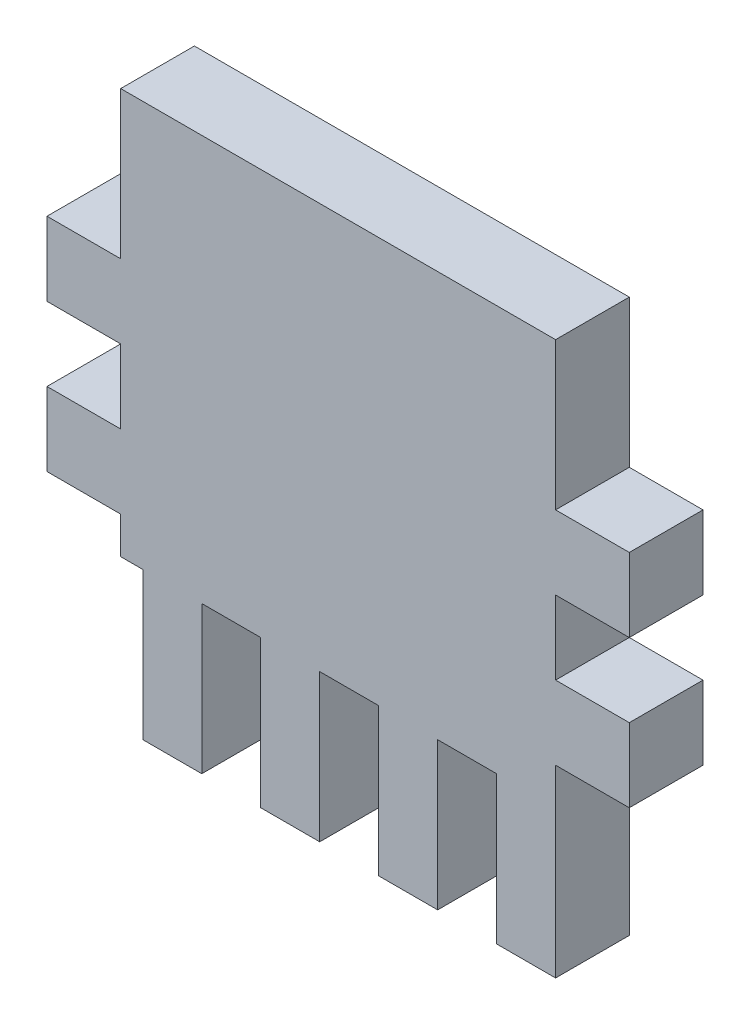
ISO-10303-21;
HEADER;
FILE_DESCRIPTION(('STEP AP214'),'2;1');
FILE_NAME('part.step','',(''),(''),'','','');
FILE_SCHEMA(('AUTOMOTIVE_DESIGN { 1 0 10303 214 1 1 1 1 }'));
ENDSEC;
DATA;
#1=APPLICATION_CONTEXT('core data for automotive mechanical design processes');
#2=APPLICATION_PROTOCOL_DEFINITION('international standard','automotive_design',2000,#1);
#3=PRODUCT_CONTEXT('',#1,'mechanical');
#4=PRODUCT('Part','Part','',(#3));
#5=PRODUCT_RELATED_PRODUCT_CATEGORY('part','',(#4));
#6=PRODUCT_DEFINITION_FORMATION('','',#4);
#7=PRODUCT_DEFINITION_CONTEXT('part definition',#1,'design');
#8=PRODUCT_DEFINITION('design','',#6,#7);
#9=PRODUCT_DEFINITION_SHAPE('','',#8);
#10=(LENGTH_UNIT() NAMED_UNIT(*) SI_UNIT(.MILLI.,.METRE.));
#11=(NAMED_UNIT(*) PLANE_ANGLE_UNIT() SI_UNIT($,.RADIAN.));
#12=(NAMED_UNIT(*) SI_UNIT($,.STERADIAN.) SOLID_ANGLE_UNIT());
#13=UNCERTAINTY_MEASURE_WITH_UNIT(LENGTH_MEASURE(1.E-05),#10,'distance_accuracy_value','');
#14=(GEOMETRIC_REPRESENTATION_CONTEXT(3) GLOBAL_UNCERTAINTY_ASSIGNED_CONTEXT((#13)) GLOBAL_UNIT_ASSIGNED_CONTEXT((#10,
#11,#12)) REPRESENTATION_CONTEXT('',''));
#15=CARTESIAN_POINT('',(0.,0.,0.));
#16=DIRECTION('',(0.,0.,1.));
#17=DIRECTION('',(1.,0.,0.));
#18=AXIS2_PLACEMENT_3D('',#15,#16,#17);
#19=CARTESIAN_POINT('',(0.,-8.71306122857178,5.));
#20=DIRECTION('',(0.,1.,0.));
#21=DIRECTION('',(-1.,0.,0.));
#22=AXIS2_PLACEMENT_3D('',#19,#20,#21);
#23=PLANE('',#22);
#24=DIRECTION('',(1.,0.,0.));
#25=VECTOR('',#24,1.);
#26=CARTESIAN_POINT('',(0.,-8.71306122857178,0.));
#27=LINE('',#26,#25);
#28=CARTESIAN_POINT('',(-8.40934146575976,-8.71306122857178,0.));
#29=VERTEX_POINT('',#28);
#30=CARTESIAN_POINT('',(-4.40934146575976,-8.71306122857178,0.));
#31=VERTEX_POINT('',#30);
#32=EDGE_CURVE('E370',#29,#31,#27,.T.);
#33=ORIENTED_EDGE('',*,*,#32,.T.);
#34=DIRECTION('',(0.,0.,-1.));
#35=VECTOR('',#34,1.);
#36=CARTESIAN_POINT('',(-4.40934146575976,-8.71306122857178,5.));
#37=LINE('',#36,#35);
#38=CARTESIAN_POINT('',(-4.40934146575976,-8.71306122857178,5.));
#39=VERTEX_POINT('',#38);
#40=EDGE_CURVE('E209',#39,#31,#37,.T.);
#41=ORIENTED_EDGE('',*,*,#40,.F.);
#42=DIRECTION('',(1.,0.,0.));
#43=VECTOR('',#42,1.);
#44=CARTESIAN_POINT('',(0.,-8.71306122857178,5.));
#45=LINE('',#44,#43);
#46=CARTESIAN_POINT('',(-8.40934146575976,-8.71306122857178,5.));
#47=VERTEX_POINT('',#46);
#48=EDGE_CURVE('E446',#47,#39,#45,.T.);
#49=ORIENTED_EDGE('',*,*,#48,.F.);
#50=DIRECTION('',(0.,0.,-1.));
#51=VECTOR('',#50,1.);
#52=CARTESIAN_POINT('',(-8.40934146575976,-8.71306122857178,5.));
#53=LINE('',#52,#51);
#54=EDGE_CURVE('E206',#47,#29,#53,.T.);
#55=ORIENTED_EDGE('',*,*,#54,.T.);
#56=EDGE_LOOP('',(#33,#41,#49,#55));
#57=FACE_BOUND('',#56,.T.);
#58=ADVANCED_FACE('F137',(#57),#23,.F.);
#59=CARTESIAN_POINT('',(-4.40934146575976,0.,5.));
#60=DIRECTION('',(1.,0.,0.));
#61=DIRECTION('',(0.,1.,0.));
#62=AXIS2_PLACEMENT_3D('',#59,#60,#61);
#63=PLANE('',#62);
#64=DIRECTION('',(0.,-1.,0.));
#65=VECTOR('',#64,1.);
#66=CARTESIAN_POINT('',(-4.40934146575976,0.,0.));
#67=LINE('',#66,#65);
#68=CARTESIAN_POINT('',(-4.40934146575975,-18.7130612285718,0.));
#69=VERTEX_POINT('',#68);
#70=EDGE_CURVE('E367',#31,#69,#67,.T.);
#71=ORIENTED_EDGE('',*,*,#70,.T.);
#72=DIRECTION('',(0.,0.,-1.));
#73=VECTOR('',#72,1.);
#74=CARTESIAN_POINT('',(-4.40934146575975,-18.7130612285718,5.));
#75=LINE('',#74,#73);
#76=CARTESIAN_POINT('',(-4.40934146575975,-18.7130612285718,5.));
#77=VERTEX_POINT('',#76);
#78=EDGE_CURVE('E212',#77,#69,#75,.T.);
#79=ORIENTED_EDGE('',*,*,#78,.F.);
#80=DIRECTION('',(0.,-1.,0.));
#81=VECTOR('',#80,1.);
#82=CARTESIAN_POINT('',(-4.40934146575976,0.,5.));
#83=LINE('',#82,#81);
#84=EDGE_CURVE('E443',#39,#77,#83,.T.);
#85=ORIENTED_EDGE('',*,*,#84,.F.);
#86=ORIENTED_EDGE('',*,*,#40,.T.);
#87=EDGE_LOOP('',(#71,#79,#85,#86));
#88=FACE_BOUND('',#87,.T.);
#89=ADVANCED_FACE('F715',(#88),#63,.F.);
#90=CARTESIAN_POINT('',(0.,-18.7130612285718,5.));
#91=DIRECTION('',(0.,1.,0.));
#92=DIRECTION('',(0.,0.,1.));
#93=AXIS2_PLACEMENT_3D('',#90,#91,#92);
#94=PLANE('',#93);
#95=DIRECTION('',(1.,0.,0.));
#96=VECTOR('',#95,1.);
#97=CARTESIAN_POINT('',(0.,-18.7130612285718,0.));
#98=LINE('',#97,#96);
#99=CARTESIAN_POINT('',(-0.409341465759753,-18.7130612285718,0.));
#100=VERTEX_POINT('',#99);
#101=EDGE_CURVE('E364',#69,#100,#98,.T.);
#102=ORIENTED_EDGE('',*,*,#101,.T.);
#103=DIRECTION('',(0.,0.,-1.));
#104=VECTOR('',#103,1.);
#105=CARTESIAN_POINT('',(-0.409341465759753,-18.7130612285718,5.));
#106=LINE('',#105,#104);
#107=CARTESIAN_POINT('',(-0.409341465759753,-18.7130612285718,5.));
#108=VERTEX_POINT('',#107);
#109=EDGE_CURVE('E215',#108,#100,#106,.T.);
#110=ORIENTED_EDGE('',*,*,#109,.F.);
#111=DIRECTION('',(1.,0.,0.));
#112=VECTOR('',#111,1.);
#113=CARTESIAN_POINT('',(0.,-18.7130612285718,5.));
#114=LINE('',#113,#112);
#115=EDGE_CURVE('E440',#77,#108,#114,.T.);
#116=ORIENTED_EDGE('',*,*,#115,.F.);
#117=ORIENTED_EDGE('',*,*,#78,.T.);
#118=EDGE_LOOP('',(#102,#110,#116,#117));
#119=FACE_BOUND('',#118,.T.);
#120=ADVANCED_FACE('F721',(#119),#94,.F.);
#121=CARTESIAN_POINT('',(-0.409341465759757,0.,5.));
#122=DIRECTION('',(1.,0.,0.));
#123=DIRECTION('',(0.,1.,0.));
#124=AXIS2_PLACEMENT_3D('',#121,#122,#123);
#125=PLANE('',#124);
#126=DIRECTION('',(0.,-1.,0.));
#127=VECTOR('',#126,1.);
#128=CARTESIAN_POINT('',(-0.409341465759757,0.,0.));
#129=LINE('',#128,#127);
#130=CARTESIAN_POINT('',(-0.409341465759755,-8.71306122857178,0.));
#131=VERTEX_POINT('',#130);
#132=EDGE_CURVE('E361',#131,#100,#129,.T.);
#133=ORIENTED_EDGE('',*,*,#132,.F.);
#134=DIRECTION('',(0.,0.,-1.));
#135=VECTOR('',#134,1.);
#136=CARTESIAN_POINT('',(-0.409341465759755,-8.71306122857178,5.));
#137=LINE('',#136,#135);
#138=CARTESIAN_POINT('',(-0.409341465759755,-8.71306122857178,5.));
#139=VERTEX_POINT('',#138);
#140=EDGE_CURVE('E218',#139,#131,#137,.T.);
#141=ORIENTED_EDGE('',*,*,#140,.F.);
#142=DIRECTION('',(0.,-1.,0.));
#143=VECTOR('',#142,1.);
#144=CARTESIAN_POINT('',(-0.409341465759757,0.,5.));
#145=LINE('',#144,#143);
#146=EDGE_CURVE('E437',#139,#108,#145,.T.);
#147=ORIENTED_EDGE('',*,*,#146,.T.);
#148=ORIENTED_EDGE('',*,*,#109,.T.);
#149=EDGE_LOOP('',(#133,#141,#147,#148));
#150=FACE_BOUND('',#149,.T.);
#151=ADVANCED_FACE('F726',(#150),#125,.T.);
#152=CARTESIAN_POINT('',(3.59065853424024,-8.71306122857178,0.));
#153=VERTEX_POINT('',#152);
#154=EDGE_CURVE('E360',#131,#153,#27,.T.);
#155=ORIENTED_EDGE('',*,*,#154,.T.);
#156=DIRECTION('',(0.,0.,-1.));
#157=VECTOR('',#156,1.);
#158=CARTESIAN_POINT('',(3.59065853424024,-8.71306122857178,5.));
#159=LINE('',#158,#157);
#160=CARTESIAN_POINT('',(3.59065853424024,-8.71306122857178,5.));
#161=VERTEX_POINT('',#160);
#162=EDGE_CURVE('E221',#161,#153,#159,.T.);
#163=ORIENTED_EDGE('',*,*,#162,.F.);
#164=EDGE_CURVE('E436',#139,#161,#45,.T.);
#165=ORIENTED_EDGE('',*,*,#164,.F.);
#166=ORIENTED_EDGE('',*,*,#140,.T.);
#167=EDGE_LOOP('',(#155,#163,#165,#166));
#168=FACE_BOUND('',#167,.T.);
#169=ADVANCED_FACE('F631',(#168),#23,.F.);
#170=CARTESIAN_POINT('',(3.59065853424024,0.,5.));
#171=DIRECTION('',(1.,0.,0.));
#172=DIRECTION('',(0.,0.,-1.));
#173=AXIS2_PLACEMENT_3D('',#170,#171,#172);
#174=PLANE('',#173);
#175=DIRECTION('',(0.,-1.,0.));
#176=VECTOR('',#175,1.);
#177=CARTESIAN_POINT('',(3.59065853424024,0.,0.));
#178=LINE('',#177,#176);
#179=CARTESIAN_POINT('',(3.59065853424024,-18.7130612285718,0.));
#180=VERTEX_POINT('',#179);
#181=EDGE_CURVE('E357',#153,#180,#178,.T.);
#182=ORIENTED_EDGE('',*,*,#181,.T.);
#183=DIRECTION('',(0.,0.,-1.));
#184=VECTOR('',#183,1.);
#185=CARTESIAN_POINT('',(3.59065853424024,-18.7130612285718,5.));
#186=LINE('',#185,#184);
#187=CARTESIAN_POINT('',(3.59065853424024,-18.7130612285718,5.));
#188=VERTEX_POINT('',#187);
#189=EDGE_CURVE('E224',#188,#180,#186,.T.);
#190=ORIENTED_EDGE('',*,*,#189,.F.);
#191=DIRECTION('',(0.,-1.,0.));
#192=VECTOR('',#191,1.);
#193=CARTESIAN_POINT('',(3.59065853424024,0.,5.));
#194=LINE('',#193,#192);
#195=EDGE_CURVE('E433',#161,#188,#194,.T.);
#196=ORIENTED_EDGE('',*,*,#195,.F.);
#197=ORIENTED_EDGE('',*,*,#162,.T.);
#198=EDGE_LOOP('',(#182,#190,#196,#197));
#199=FACE_BOUND('',#198,.T.);
#200=ADVANCED_FACE('F635',(#199),#174,.F.);
#201=CARTESIAN_POINT('',(0.,-18.7130612285718,5.));
#202=DIRECTION('',(0.,1.,0.));
#203=DIRECTION('',(0.,0.,1.));
#204=AXIS2_PLACEMENT_3D('',#201,#202,#203);
#205=PLANE('',#204);
#206=DIRECTION('',(1.,0.,0.));
#207=VECTOR('',#206,1.);
#208=CARTESIAN_POINT('',(0.,-18.7130612285718,0.));
#209=LINE('',#208,#207);
#210=CARTESIAN_POINT('',(7.59065853424025,-18.7130612285718,0.));
#211=VERTEX_POINT('',#210);
#212=EDGE_CURVE('E354',#180,#211,#209,.T.);
#213=ORIENTED_EDGE('',*,*,#212,.T.);
#214=DIRECTION('',(0.,0.,-1.));
#215=VECTOR('',#214,1.);
#216=CARTESIAN_POINT('',(7.59065853424025,-18.7130612285718,5.));
#217=LINE('',#216,#215);
#218=CARTESIAN_POINT('',(7.59065853424025,-18.7130612285718,5.));
#219=VERTEX_POINT('',#218);
#220=EDGE_CURVE('E227',#219,#211,#217,.T.);
#221=ORIENTED_EDGE('',*,*,#220,.F.);
#222=DIRECTION('',(1.,0.,0.));
#223=VECTOR('',#222,1.);
#224=CARTESIAN_POINT('',(0.,-18.7130612285718,5.));
#225=LINE('',#224,#223);
#226=EDGE_CURVE('E430',#188,#219,#225,.T.);
#227=ORIENTED_EDGE('',*,*,#226,.F.);
#228=ORIENTED_EDGE('',*,*,#189,.T.);
#229=EDGE_LOOP('',(#213,#221,#227,#228));
#230=FACE_BOUND('',#229,.T.);
#231=ADVANCED_FACE('F640',(#230),#205,.F.);
#232=CARTESIAN_POINT('',(7.59065853424025,0.,5.));
#233=DIRECTION('',(1.,0.,0.));
#234=DIRECTION('',(0.,1.,0.));
#235=AXIS2_PLACEMENT_3D('',#232,#233,#234);
#236=PLANE('',#235);
#237=DIRECTION('',(0.,-1.,0.));
#238=VECTOR('',#237,1.);
#239=CARTESIAN_POINT('',(7.59065853424025,0.,0.));
#240=LINE('',#239,#238);
#241=CARTESIAN_POINT('',(7.59065853424025,-8.71306122857178,0.));
#242=VERTEX_POINT('',#241);
#243=EDGE_CURVE('E351',#242,#211,#240,.T.);
#244=ORIENTED_EDGE('',*,*,#243,.F.);
#245=DIRECTION('',(0.,0.,-1.));
#246=VECTOR('',#245,1.);
#247=CARTESIAN_POINT('',(7.59065853424025,-8.71306122857178,5.));
#248=LINE('',#247,#246);
#249=CARTESIAN_POINT('',(7.59065853424025,-8.71306122857178,5.));
#250=VERTEX_POINT('',#249);
#251=EDGE_CURVE('E230',#250,#242,#248,.T.);
#252=ORIENTED_EDGE('',*,*,#251,.F.);
#253=DIRECTION('',(0.,-1.,0.));
#254=VECTOR('',#253,1.);
#255=CARTESIAN_POINT('',(7.59065853424025,0.,5.));
#256=LINE('',#255,#254);
#257=EDGE_CURVE('E427',#250,#219,#256,.T.);
#258=ORIENTED_EDGE('',*,*,#257,.T.);
#259=ORIENTED_EDGE('',*,*,#220,.T.);
#260=EDGE_LOOP('',(#244,#252,#258,#259));
#261=FACE_BOUND('',#260,.T.);
#262=ADVANCED_FACE('F643',(#261),#236,.T.);
#263=CARTESIAN_POINT('',(11.5906585342402,-8.71306122857178,0.));
#264=VERTEX_POINT('',#263);
#265=EDGE_CURVE('E350',#242,#264,#27,.T.);
#266=ORIENTED_EDGE('',*,*,#265,.T.);
#267=DIRECTION('',(0.,0.,-1.));
#268=VECTOR('',#267,1.);
#269=CARTESIAN_POINT('',(11.5906585342402,-8.71306122857178,5.));
#270=LINE('',#269,#268);
#271=CARTESIAN_POINT('',(11.5906585342402,-8.71306122857178,5.));
#272=VERTEX_POINT('',#271);
#273=EDGE_CURVE('E233',#272,#264,#270,.T.);
#274=ORIENTED_EDGE('',*,*,#273,.F.);
#275=EDGE_CURVE('E426',#250,#272,#45,.T.);
#276=ORIENTED_EDGE('',*,*,#275,.F.);
#277=ORIENTED_EDGE('',*,*,#251,.T.);
#278=EDGE_LOOP('',(#266,#274,#276,#277));
#279=FACE_BOUND('',#278,.T.);
#280=ADVANCED_FACE('F646',(#279),#23,.F.);
#281=CARTESIAN_POINT('',(11.5906585342402,0.,5.));
#282=DIRECTION('',(1.,0.,0.));
#283=DIRECTION('',(0.,1.,0.));
#284=AXIS2_PLACEMENT_3D('',#281,#282,#283);
#285=PLANE('',#284);
#286=DIRECTION('',(0.,-1.,0.));
#287=VECTOR('',#286,1.);
#288=CARTESIAN_POINT('',(11.5906585342402,0.,0.));
#289=LINE('',#288,#287);
#290=CARTESIAN_POINT('',(11.5906585342402,-18.7130612285718,0.));
#291=VERTEX_POINT('',#290);
#292=EDGE_CURVE('E347',#264,#291,#289,.T.);
#293=ORIENTED_EDGE('',*,*,#292,.T.);
#294=DIRECTION('',(0.,0.,-1.));
#295=VECTOR('',#294,1.);
#296=CARTESIAN_POINT('',(11.5906585342402,-18.7130612285718,5.));
#297=LINE('',#296,#295);
#298=CARTESIAN_POINT('',(11.5906585342402,-18.7130612285718,5.));
#299=VERTEX_POINT('',#298);
#300=EDGE_CURVE('E236',#299,#291,#297,.T.);
#301=ORIENTED_EDGE('',*,*,#300,.F.);
#302=DIRECTION('',(0.,-1.,0.));
#303=VECTOR('',#302,1.);
#304=CARTESIAN_POINT('',(11.5906585342402,0.,5.));
#305=LINE('',#304,#303);
#306=EDGE_CURVE('E423',#272,#299,#305,.T.);
#307=ORIENTED_EDGE('',*,*,#306,.F.);
#308=ORIENTED_EDGE('',*,*,#273,.T.);
#309=EDGE_LOOP('',(#293,#301,#307,#308));
#310=FACE_BOUND('',#309,.T.);
#311=ADVANCED_FACE('F651',(#310),#285,.F.);
#312=CARTESIAN_POINT('',(0.,-18.7130612285718,5.));
#313=DIRECTION('',(0.,-1.,0.));
#314=DIRECTION('',(0.,0.,-1.));
#315=AXIS2_PLACEMENT_3D('',#312,#313,#314);
#316=PLANE('',#315);
#317=DIRECTION('',(-1.,0.,0.));
#318=VECTOR('',#317,1.);
#319=CARTESIAN_POINT('',(0.,-18.7130612285718,0.));
#320=LINE('',#319,#318);
#321=CARTESIAN_POINT('',(15.5906585342402,-18.7130612285718,0.));
#322=VERTEX_POINT('',#321);
#323=EDGE_CURVE('E344',#322,#291,#320,.T.);
#324=ORIENTED_EDGE('',*,*,#323,.F.);
#325=DIRECTION('',(0.,0.,-1.));
#326=VECTOR('',#325,1.);
#327=CARTESIAN_POINT('',(15.5906585342402,-18.7130612285718,5.));
#328=LINE('',#327,#326);
#329=CARTESIAN_POINT('',(15.5906585342402,-18.7130612285718,5.));
#330=VERTEX_POINT('',#329);
#331=EDGE_CURVE('E239',#330,#322,#328,.T.);
#332=ORIENTED_EDGE('',*,*,#331,.F.);
#333=DIRECTION('',(-1.,0.,0.));
#334=VECTOR('',#333,1.);
#335=CARTESIAN_POINT('',(0.,-18.7130612285718,5.));
#336=LINE('',#335,#334);
#337=EDGE_CURVE('E420',#330,#299,#336,.T.);
#338=ORIENTED_EDGE('',*,*,#337,.T.);
#339=ORIENTED_EDGE('',*,*,#300,.T.);
#340=EDGE_LOOP('',(#324,#332,#338,#339));
#341=FACE_BOUND('',#340,.T.);
#342=ADVANCED_FACE('F658',(#341),#316,.T.);
#343=CARTESIAN_POINT('',(15.5906585342402,0.,5.));
#344=DIRECTION('',(-1.,0.,0.));
#345=DIRECTION('',(0.,0.,1.));
#346=AXIS2_PLACEMENT_3D('',#343,#344,#345);
#347=PLANE('',#346);
#348=DIRECTION('',(0.,1.,0.));
#349=VECTOR('',#348,1.);
#350=CARTESIAN_POINT('',(15.5906585342402,0.,0.));
#351=LINE('',#350,#349);
#352=CARTESIAN_POINT('',(15.5906585342402,-6.21306122857178,0.));
#353=VERTEX_POINT('',#352);
#354=EDGE_CURVE('E341',#322,#353,#351,.T.);
#355=ORIENTED_EDGE('',*,*,#354,.T.);
#356=DIRECTION('',(0.,0.,-1.));
#357=VECTOR('',#356,1.);
#358=CARTESIAN_POINT('',(15.5906585342402,-6.21306122857178,5.));
#359=LINE('',#358,#357);
#360=CARTESIAN_POINT('',(15.5906585342402,-6.21306122857178,5.));
#361=VERTEX_POINT('',#360);
#362=EDGE_CURVE('E242',#361,#353,#359,.T.);
#363=ORIENTED_EDGE('',*,*,#362,.F.);
#364=DIRECTION('',(0.,1.,0.));
#365=VECTOR('',#364,1.);
#366=CARTESIAN_POINT('',(15.5906585342402,0.,5.));
#367=LINE('',#366,#365);
#368=EDGE_CURVE('E417',#330,#361,#367,.T.);
#369=ORIENTED_EDGE('',*,*,#368,.F.);
#370=ORIENTED_EDGE('',*,*,#331,.T.);
#371=EDGE_LOOP('',(#355,#363,#369,#370));
#372=FACE_BOUND('',#371,.T.);
#373=ADVANCED_FACE('F661',(#372),#347,.F.);
#374=CARTESIAN_POINT('',(0.,-6.21306122857178,5.));
#375=DIRECTION('',(0.,-1.,0.));
#376=DIRECTION('',(0.,0.,-1.));
#377=AXIS2_PLACEMENT_3D('',#374,#375,#376);
#378=PLANE('',#377);
#379=DIRECTION('',(-1.,0.,0.));
#380=VECTOR('',#379,1.);
#381=CARTESIAN_POINT('',(0.,-6.21306122857178,0.));
#382=LINE('',#381,#380);
#383=CARTESIAN_POINT('',(20.5906585342402,-6.21306122857178,0.));
#384=VERTEX_POINT('',#383);
#385=EDGE_CURVE('E338',#384,#353,#382,.T.);
#386=ORIENTED_EDGE('',*,*,#385,.F.);
#387=DIRECTION('',(0.,0.,-1.));
#388=VECTOR('',#387,1.);
#389=CARTESIAN_POINT('',(20.5906585342402,-6.21306122857178,5.));
#390=LINE('',#389,#388);
#391=CARTESIAN_POINT('',(20.5906585342402,-6.21306122857178,5.));
#392=VERTEX_POINT('',#391);
#393=EDGE_CURVE('E245',#392,#384,#390,.T.);
#394=ORIENTED_EDGE('',*,*,#393,.F.);
#395=DIRECTION('',(-1.,0.,0.));
#396=VECTOR('',#395,1.);
#397=CARTESIAN_POINT('',(0.,-6.21306122857178,5.));
#398=LINE('',#397,#396);
#399=EDGE_CURVE('E414',#392,#361,#398,.T.);
#400=ORIENTED_EDGE('',*,*,#399,.T.);
#401=ORIENTED_EDGE('',*,*,#362,.T.);
#402=EDGE_LOOP('',(#386,#394,#400,#401));
#403=FACE_BOUND('',#402,.T.);
#404=ADVANCED_FACE('F664',(#403),#378,.T.);
#405=CARTESIAN_POINT('',(20.5906585342402,0.,5.));
#406=DIRECTION('',(-1.,0.,0.));
#407=DIRECTION('',(0.,0.,1.));
#408=AXIS2_PLACEMENT_3D('',#405,#406,#407);
#409=PLANE('',#408);
#410=DIRECTION('',(0.,1.,0.));
#411=VECTOR('',#410,1.);
#412=CARTESIAN_POINT('',(20.5906585342402,0.,0.));
#413=LINE('',#412,#411);
#414=CARTESIAN_POINT('',(20.5906585342402,-1.21306122857178,0.));
#415=VERTEX_POINT('',#414);
#416=EDGE_CURVE('E335',#384,#415,#413,.T.);
#417=ORIENTED_EDGE('',*,*,#416,.T.);
#418=DIRECTION('',(0.,0.,-1.));
#419=VECTOR('',#418,1.);
#420=CARTESIAN_POINT('',(20.5906585342402,-1.21306122857178,5.));
#421=LINE('',#420,#419);
#422=CARTESIAN_POINT('',(20.5906585342402,-1.21306122857178,5.));
#423=VERTEX_POINT('',#422);
#424=EDGE_CURVE('E248',#423,#415,#421,.T.);
#425=ORIENTED_EDGE('',*,*,#424,.F.);
#426=DIRECTION('',(0.,1.,0.));
#427=VECTOR('',#426,1.);
#428=CARTESIAN_POINT('',(20.5906585342402,0.,5.));
#429=LINE('',#428,#427);
#430=EDGE_CURVE('E411',#392,#423,#429,.T.);
#431=ORIENTED_EDGE('',*,*,#430,.F.);
#432=ORIENTED_EDGE('',*,*,#393,.T.);
#433=EDGE_LOOP('',(#417,#425,#431,#432));
#434=FACE_BOUND('',#433,.T.);
#435=ADVANCED_FACE('F669',(#434),#409,.F.);
#436=CARTESIAN_POINT('',(0.,-1.21306122857178,5.));
#437=DIRECTION('',(0.,1.,0.));
#438=DIRECTION('',(0.,0.,1.));
#439=AXIS2_PLACEMENT_3D('',#436,#437,#438);
#440=PLANE('',#439);
#441=DIRECTION('',(1.,0.,0.));
#442=VECTOR('',#441,1.);
#443=CARTESIAN_POINT('',(0.,-1.21306122857178,0.));
#444=LINE('',#443,#442);
#445=CARTESIAN_POINT('',(15.5906585342402,-1.21306122857178,0.));
#446=VERTEX_POINT('',#445);
#447=EDGE_CURVE('E332',#446,#415,#444,.T.);
#448=ORIENTED_EDGE('',*,*,#447,.F.);
#449=DIRECTION('',(0.,0.,-1.));
#450=VECTOR('',#449,1.);
#451=CARTESIAN_POINT('',(15.5906585342402,-1.21306122857178,5.));
#452=LINE('',#451,#450);
#453=CARTESIAN_POINT('',(15.5906585342402,-1.21306122857178,5.));
#454=VERTEX_POINT('',#453);
#455=EDGE_CURVE('E251',#454,#446,#452,.T.);
#456=ORIENTED_EDGE('',*,*,#455,.F.);
#457=DIRECTION('',(1.,0.,0.));
#458=VECTOR('',#457,1.);
#459=CARTESIAN_POINT('',(0.,-1.21306122857178,5.));
#460=LINE('',#459,#458);
#461=EDGE_CURVE('E408',#454,#423,#460,.T.);
#462=ORIENTED_EDGE('',*,*,#461,.T.);
#463=ORIENTED_EDGE('',*,*,#424,.T.);
#464=EDGE_LOOP('',(#448,#456,#462,#463));
#465=FACE_BOUND('',#464,.T.);
#466=ADVANCED_FACE('F673',(#465),#440,.T.);
#467=CARTESIAN_POINT('',(15.5906585342402,3.78693877142822,0.));
#468=VERTEX_POINT('',#467);
#469=EDGE_CURVE('E331',#446,#468,#351,.T.);
#470=ORIENTED_EDGE('',*,*,#469,.T.);
#471=DIRECTION('',(0.,0.,-1.));
#472=VECTOR('',#471,1.);
#473=CARTESIAN_POINT('',(15.5906585342402,3.78693877142822,5.));
#474=LINE('',#473,#472);
#475=CARTESIAN_POINT('',(15.5906585342402,3.78693877142822,5.));
#476=VERTEX_POINT('',#475);
#477=EDGE_CURVE('E254',#476,#468,#474,.T.);
#478=ORIENTED_EDGE('',*,*,#477,.F.);
#479=EDGE_CURVE('E407',#454,#476,#367,.T.);
#480=ORIENTED_EDGE('',*,*,#479,.F.);
#481=ORIENTED_EDGE('',*,*,#455,.T.);
#482=EDGE_LOOP('',(#470,#478,#480,#481));
#483=FACE_BOUND('',#482,.T.);
#484=ADVANCED_FACE('F678',(#483),#347,.F.);
#485=CARTESIAN_POINT('',(0.,3.78693877142822,5.));
#486=DIRECTION('',(0.,1.,0.));
#487=DIRECTION('',(-1.,0.,0.));
#488=AXIS2_PLACEMENT_3D('',#485,#486,#487);
#489=PLANE('',#488);
#490=DIRECTION('',(1.,0.,0.));
#491=VECTOR('',#490,1.);
#492=CARTESIAN_POINT('',(0.,3.78693877142822,0.));
#493=LINE('',#492,#491);
#494=CARTESIAN_POINT('',(20.5906585342402,3.78693877142822,0.));
#495=VERTEX_POINT('',#494);
#496=EDGE_CURVE('E328',#468,#495,#493,.T.);
#497=ORIENTED_EDGE('',*,*,#496,.T.);
#498=DIRECTION('',(0.,0.,-1.));
#499=VECTOR('',#498,1.);
#500=CARTESIAN_POINT('',(20.5906585342402,3.78693877142822,5.));
#501=LINE('',#500,#499);
#502=CARTESIAN_POINT('',(20.5906585342402,3.78693877142822,5.));
#503=VERTEX_POINT('',#502);
#504=EDGE_CURVE('E257',#503,#495,#501,.T.);
#505=ORIENTED_EDGE('',*,*,#504,.F.);
#506=DIRECTION('',(1.,0.,0.));
#507=VECTOR('',#506,1.);
#508=CARTESIAN_POINT('',(0.,3.78693877142822,5.));
#509=LINE('',#508,#507);
#510=EDGE_CURVE('E404',#476,#503,#509,.T.);
#511=ORIENTED_EDGE('',*,*,#510,.F.);
#512=ORIENTED_EDGE('',*,*,#477,.T.);
#513=EDGE_LOOP('',(#497,#505,#511,#512));
#514=FACE_BOUND('',#513,.T.);
#515=ADVANCED_FACE('F880',(#514),#489,.F.);
#516=CARTESIAN_POINT('',(20.5906585342402,0.,5.));
#517=DIRECTION('',(-1.,0.,0.));
#518=DIRECTION('',(0.,0.,1.));
#519=AXIS2_PLACEMENT_3D('',#516,#517,#518);
#520=PLANE('',#519);
#521=DIRECTION('',(0.,1.,0.));
#522=VECTOR('',#521,1.);
#523=CARTESIAN_POINT('',(20.5906585342402,0.,0.));
#524=LINE('',#523,#522);
#525=CARTESIAN_POINT('',(20.5906585342402,8.78693877142822,0.));
#526=VERTEX_POINT('',#525);
#527=EDGE_CURVE('E325',#495,#526,#524,.T.);
#528=ORIENTED_EDGE('',*,*,#527,.T.);
#529=DIRECTION('',(0.,0.,-1.));
#530=VECTOR('',#529,1.);
#531=CARTESIAN_POINT('',(20.5906585342402,8.78693877142822,5.));
#532=LINE('',#531,#530);
#533=CARTESIAN_POINT('',(20.5906585342402,8.78693877142822,5.));
#534=VERTEX_POINT('',#533);
#535=EDGE_CURVE('E260',#534,#526,#532,.T.);
#536=ORIENTED_EDGE('',*,*,#535,.F.);
#537=DIRECTION('',(0.,1.,0.));
#538=VECTOR('',#537,1.);
#539=CARTESIAN_POINT('',(20.5906585342402,0.,5.));
#540=LINE('',#539,#538);
#541=EDGE_CURVE('E401',#503,#534,#540,.T.);
#542=ORIENTED_EDGE('',*,*,#541,.F.);
#543=ORIENTED_EDGE('',*,*,#504,.T.);
#544=EDGE_LOOP('',(#528,#536,#542,#543));
#545=FACE_BOUND('',#544,.T.);
#546=ADVANCED_FACE('F869',(#545),#520,.F.);
#547=CARTESIAN_POINT('',(0.,8.78693877142822,5.));
#548=DIRECTION('',(0.,1.,0.));
#549=DIRECTION('',(0.,0.,1.));
#550=AXIS2_PLACEMENT_3D('',#547,#548,#549);
#551=PLANE('',#550);
#552=DIRECTION('',(1.,0.,0.));
#553=VECTOR('',#552,1.);
#554=CARTESIAN_POINT('',(0.,8.78693877142822,0.));
#555=LINE('',#554,#553);
#556=CARTESIAN_POINT('',(15.5906585342402,8.78693877142822,0.));
#557=VERTEX_POINT('',#556);
#558=EDGE_CURVE('E322',#557,#526,#555,.T.);
#559=ORIENTED_EDGE('',*,*,#558,.F.);
#560=DIRECTION('',(0.,0.,-1.));
#561=VECTOR('',#560,1.);
#562=CARTESIAN_POINT('',(15.5906585342402,8.78693877142822,5.));
#563=LINE('',#562,#561);
#564=CARTESIAN_POINT('',(15.5906585342402,8.78693877142822,5.));
#565=VERTEX_POINT('',#564);
#566=EDGE_CURVE('E263',#565,#557,#563,.T.);
#567=ORIENTED_EDGE('',*,*,#566,.F.);
#568=DIRECTION('',(1.,0.,0.));
#569=VECTOR('',#568,1.);
#570=CARTESIAN_POINT('',(0.,8.78693877142822,5.));
#571=LINE('',#570,#569);
#572=EDGE_CURVE('E398',#565,#534,#571,.T.);
#573=ORIENTED_EDGE('',*,*,#572,.T.);
#574=ORIENTED_EDGE('',*,*,#535,.T.);
#575=EDGE_LOOP('',(#559,#567,#573,#574));
#576=FACE_BOUND('',#575,.T.);
#577=ADVANCED_FACE('F859',(#576),#551,.T.);
#578=CARTESIAN_POINT('',(15.5906585342402,18.7869387714282,0.));
#579=VERTEX_POINT('',#578);
#580=EDGE_CURVE('E321',#557,#579,#351,.T.);
#581=ORIENTED_EDGE('',*,*,#580,.T.);
#582=DIRECTION('',(0.,0.,-1.));
#583=VECTOR('',#582,1.);
#584=CARTESIAN_POINT('',(15.5906585342402,18.7869387714282,5.));
#585=LINE('',#584,#583);
#586=CARTESIAN_POINT('',(15.5906585342402,18.7869387714282,5.));
#587=VERTEX_POINT('',#586);
#588=EDGE_CURVE('E266',#587,#579,#585,.T.);
#589=ORIENTED_EDGE('',*,*,#588,.F.);
#590=EDGE_CURVE('E397',#565,#587,#367,.T.);
#591=ORIENTED_EDGE('',*,*,#590,.F.);
#592=ORIENTED_EDGE('',*,*,#566,.T.);
#593=EDGE_LOOP('',(#581,#589,#591,#592));
#594=FACE_BOUND('',#593,.T.);
#595=ADVANCED_FACE('F685',(#594),#347,.F.);
#596=CARTESIAN_POINT('',(0.,18.7869387714282,5.));
#597=DIRECTION('',(0.,1.,0.));
#598=DIRECTION('',(-1.,0.,0.));
#599=AXIS2_PLACEMENT_3D('',#596,#597,#598);
#600=PLANE('',#599);
#601=DIRECTION('',(1.,0.,0.));
#602=VECTOR('',#601,1.);
#603=CARTESIAN_POINT('',(0.,18.7869387714282,0.));
#604=LINE('',#603,#602);
#605=CARTESIAN_POINT('',(-13.9093414657598,18.7869387714282,0.));
#606=VERTEX_POINT('',#605);
#607=EDGE_CURVE('E318',#606,#579,#604,.T.);
#608=ORIENTED_EDGE('',*,*,#607,.F.);
#609=DIRECTION('',(0.,0.,-1.));
#610=VECTOR('',#609,1.);
#611=CARTESIAN_POINT('',(-13.9093414657598,18.7869387714282,5.));
#612=LINE('',#611,#610);
#613=CARTESIAN_POINT('',(-13.9093414657598,18.7869387714282,5.));
#614=VERTEX_POINT('',#613);
#615=EDGE_CURVE('E269',#614,#606,#612,.T.);
#616=ORIENTED_EDGE('',*,*,#615,.F.);
#617=DIRECTION('',(1.,0.,0.));
#618=VECTOR('',#617,1.);
#619=CARTESIAN_POINT('',(0.,18.7869387714282,5.));
#620=LINE('',#619,#618);
#621=EDGE_CURVE('E394',#614,#587,#620,.T.);
#622=ORIENTED_EDGE('',*,*,#621,.T.);
#623=ORIENTED_EDGE('',*,*,#588,.T.);
#624=EDGE_LOOP('',(#608,#616,#622,#623));
#625=FACE_BOUND('',#624,.T.);
#626=ADVANCED_FACE('F689',(#625),#600,.T.);
#627=CARTESIAN_POINT('',(-13.9093414657598,0.,5.));
#628=DIRECTION('',(-1.,0.,0.));
#629=DIRECTION('',(0.,0.,1.));
#630=AXIS2_PLACEMENT_3D('',#627,#628,#629);
#631=PLANE('',#630);
#632=DIRECTION('',(0.,1.,0.));
#633=VECTOR('',#632,1.);
#634=CARTESIAN_POINT('',(-13.9093414657598,0.,0.));
#635=LINE('',#634,#633);
#636=CARTESIAN_POINT('',(-13.9093414657598,8.78693877142822,0.));
#637=VERTEX_POINT('',#636);
#638=EDGE_CURVE('E317',#637,#606,#635,.T.);
#639=ORIENTED_EDGE('',*,*,#638,.F.);
#640=DIRECTION('',(0.,0.,1.));
#641=VECTOR('',#640,1.);
#642=CARTESIAN_POINT('',(-13.9093414657598,8.78693877142822,5.));
#643=LINE('',#642,#641);
#644=CARTESIAN_POINT('',(-13.9093414657598,8.78693877142822,5.));
#645=VERTEX_POINT('',#644);
#646=EDGE_CURVE('E147',#637,#645,#643,.T.);
#647=ORIENTED_EDGE('',*,*,#646,.T.);
#648=DIRECTION('',(0.,1.,0.));
#649=VECTOR('',#648,1.);
#650=CARTESIAN_POINT('',(-13.9093414657598,0.,5.));
#651=LINE('',#650,#649);
#652=EDGE_CURVE('E393',#645,#614,#651,.T.);
#653=ORIENTED_EDGE('',*,*,#652,.T.);
#654=ORIENTED_EDGE('',*,*,#615,.T.);
#655=EDGE_LOOP('',(#639,#647,#653,#654));
#656=FACE_BOUND('',#655,.T.);
#657=ADVANCED_FACE('F690',(#656),#631,.T.);
#658=DIRECTION('',(0.,0.,1.));
#659=VECTOR('',#658,1.);
#660=CARTESIAN_POINT('',(-13.9093414657598,3.78693877142822,5.));
#661=LINE('',#660,#659);
#662=CARTESIAN_POINT('',(-13.9093414657598,3.78693877142822,0.));
#663=VERTEX_POINT('',#662);
#664=CARTESIAN_POINT('',(-13.9093414657598,3.78693877142822,5.));
#665=VERTEX_POINT('',#664);
#666=EDGE_CURVE('E12',#663,#665,#661,.T.);
#667=ORIENTED_EDGE('',*,*,#666,.F.);
#668=CARTESIAN_POINT('',(-13.9093414657598,-1.21306122857178,0.));
#669=VERTEX_POINT('',#668);
#670=EDGE_CURVE('E315',#669,#663,#635,.T.);
#671=ORIENTED_EDGE('',*,*,#670,.F.);
#672=DIRECTION('',(0.,0.,-1.));
#673=VECTOR('',#672,1.);
#674=CARTESIAN_POINT('',(-13.9093414657598,-1.21306122857178,5.));
#675=LINE('',#674,#673);
#676=CARTESIAN_POINT('',(-13.9093414657598,-1.21306122857178,5.));
#677=VERTEX_POINT('',#676);
#678=EDGE_CURVE('E272',#677,#669,#675,.T.);
#679=ORIENTED_EDGE('',*,*,#678,.F.);
#680=EDGE_CURVE('E390',#677,#665,#651,.T.);
#681=ORIENTED_EDGE('',*,*,#680,.T.);
#682=EDGE_LOOP('',(#667,#671,#679,#681));
#683=FACE_BOUND('',#682,.T.);
#684=ADVANCED_FACE('F603',(#683),#631,.T.);
#685=CARTESIAN_POINT('',(0.,-1.21306122857178,5.));
#686=DIRECTION('',(0.,-1.,0.));
#687=DIRECTION('',(0.,0.,-1.));
#688=AXIS2_PLACEMENT_3D('',#685,#686,#687);
#689=PLANE('',#688);
#690=DIRECTION('',(-1.,0.,0.));
#691=VECTOR('',#690,1.);
#692=CARTESIAN_POINT('',(0.,-1.21306122857178,0.));
#693=LINE('',#692,#691);
#694=CARTESIAN_POINT('',(-18.9093414657598,-1.21306122857178,0.));
#695=VERTEX_POINT('',#694);
#696=EDGE_CURVE('E312',#669,#695,#693,.T.);
#697=ORIENTED_EDGE('',*,*,#696,.T.);
#698=DIRECTION('',(0.,0.,-1.));
#699=VECTOR('',#698,1.);
#700=CARTESIAN_POINT('',(-18.9093414657598,-1.21306122857178,5.));
#701=LINE('',#700,#699);
#702=CARTESIAN_POINT('',(-18.9093414657598,-1.21306122857178,5.));
#703=VERTEX_POINT('',#702);
#704=EDGE_CURVE('E275',#703,#695,#701,.T.);
#705=ORIENTED_EDGE('',*,*,#704,.F.);
#706=DIRECTION('',(-1.,0.,0.));
#707=VECTOR('',#706,1.);
#708=CARTESIAN_POINT('',(0.,-1.21306122857178,5.));
#709=LINE('',#708,#707);
#710=EDGE_CURVE('E387',#677,#703,#709,.T.);
#711=ORIENTED_EDGE('',*,*,#710,.F.);
#712=ORIENTED_EDGE('',*,*,#678,.T.);
#713=EDGE_LOOP('',(#697,#705,#711,#712));
#714=FACE_BOUND('',#713,.T.);
#715=ADVANCED_FACE('F611',(#714),#689,.F.);
#716=CARTESIAN_POINT('',(-18.9093414657598,0.,5.));
#717=DIRECTION('',(-1.,0.,0.));
#718=DIRECTION('',(0.,0.,1.));
#719=AXIS2_PLACEMENT_3D('',#716,#717,#718);
#720=PLANE('',#719);
#721=DIRECTION('',(0.,1.,0.));
#722=VECTOR('',#721,1.);
#723=CARTESIAN_POINT('',(-18.9093414657598,0.,0.));
#724=LINE('',#723,#722);
#725=CARTESIAN_POINT('',(-18.9093414657598,-6.21306122857178,0.));
#726=VERTEX_POINT('',#725);
#727=EDGE_CURVE('E309',#726,#695,#724,.T.);
#728=ORIENTED_EDGE('',*,*,#727,.F.);
#729=DIRECTION('',(0.,0.,-1.));
#730=VECTOR('',#729,1.);
#731=CARTESIAN_POINT('',(-18.9093414657598,-6.21306122857178,5.));
#732=LINE('',#731,#730);
#733=CARTESIAN_POINT('',(-18.9093414657598,-6.21306122857178,5.));
#734=VERTEX_POINT('',#733);
#735=EDGE_CURVE('E278',#734,#726,#732,.T.);
#736=ORIENTED_EDGE('',*,*,#735,.F.);
#737=DIRECTION('',(0.,1.,0.));
#738=VECTOR('',#737,1.);
#739=CARTESIAN_POINT('',(-18.9093414657598,0.,5.));
#740=LINE('',#739,#738);
#741=EDGE_CURVE('E384',#734,#703,#740,.T.);
#742=ORIENTED_EDGE('',*,*,#741,.T.);
#743=ORIENTED_EDGE('',*,*,#704,.T.);
#744=EDGE_LOOP('',(#728,#736,#742,#743));
#745=FACE_BOUND('',#744,.T.);
#746=ADVANCED_FACE('F805',(#745),#720,.T.);
#747=CARTESIAN_POINT('',(0.,-6.21306122857178,5.));
#748=DIRECTION('',(0.,1.,0.));
#749=DIRECTION('',(0.,0.,1.));
#750=AXIS2_PLACEMENT_3D('',#747,#748,#749);
#751=PLANE('',#750);
#752=DIRECTION('',(1.,0.,0.));
#753=VECTOR('',#752,1.);
#754=CARTESIAN_POINT('',(0.,-6.21306122857178,0.));
#755=LINE('',#754,#753);
#756=CARTESIAN_POINT('',(-13.9093414657598,-6.21306122857178,0.));
#757=VERTEX_POINT('',#756);
#758=EDGE_CURVE('E305',#726,#757,#755,.T.);
#759=ORIENTED_EDGE('',*,*,#758,.T.);
#760=DIRECTION('',(0.,0.,-1.));
#761=VECTOR('',#760,1.);
#762=CARTESIAN_POINT('',(-13.9093414657598,-6.21306122857178,5.));
#763=LINE('',#762,#761);
#764=CARTESIAN_POINT('',(-13.9093414657598,-6.21306122857178,5.));
#765=VERTEX_POINT('',#764);
#766=EDGE_CURVE('E281',#765,#757,#763,.T.);
#767=ORIENTED_EDGE('',*,*,#766,.F.);
#768=DIRECTION('',(1.,0.,0.));
#769=VECTOR('',#768,1.);
#770=CARTESIAN_POINT('',(0.,-6.21306122857178,5.));
#771=LINE('',#770,#769);
#772=EDGE_CURVE('E380',#734,#765,#771,.T.);
#773=ORIENTED_EDGE('',*,*,#772,.F.);
#774=ORIENTED_EDGE('',*,*,#735,.T.);
#775=EDGE_LOOP('',(#759,#767,#773,#774));
#776=FACE_BOUND('',#775,.T.);
#777=ADVANCED_FACE('F732',(#776),#751,.F.);
#778=CARTESIAN_POINT('',(-13.9093414657598,-8.71306122857178,0.));
#779=VERTEX_POINT('',#778);
#780=EDGE_CURVE('E308',#779,#757,#635,.T.);
#781=ORIENTED_EDGE('',*,*,#780,.F.);
#782=DIRECTION('',(0.,0.,-1.));
#783=VECTOR('',#782,1.);
#784=CARTESIAN_POINT('',(-13.9093414657598,-8.71306122857178,5.));
#785=LINE('',#784,#783);
#786=CARTESIAN_POINT('',(-13.9093414657598,-8.71306122857178,5.));
#787=VERTEX_POINT('',#786);
#788=EDGE_CURVE('E284',#787,#779,#785,.T.);
#789=ORIENTED_EDGE('',*,*,#788,.F.);
#790=EDGE_CURVE('E383',#787,#765,#651,.T.);
#791=ORIENTED_EDGE('',*,*,#790,.T.);
#792=ORIENTED_EDGE('',*,*,#766,.T.);
#793=EDGE_LOOP('',(#781,#789,#791,#792));
#794=FACE_BOUND('',#793,.T.);
#795=ADVANCED_FACE('F728',(#794),#631,.T.);
#796=CARTESIAN_POINT('',(-12.4093414657598,-8.71306122857178,0.));
#797=VERTEX_POINT('',#796);
#798=EDGE_CURVE('E304',#779,#797,#27,.T.);
#799=ORIENTED_EDGE('',*,*,#798,.T.);
#800=DIRECTION('',(0.,0.,-1.));
#801=VECTOR('',#800,1.);
#802=CARTESIAN_POINT('',(-12.4093414657598,-8.71306122857178,5.));
#803=LINE('',#802,#801);
#804=CARTESIAN_POINT('',(-12.4093414657598,-8.71306122857178,5.));
#805=VERTEX_POINT('',#804);
#806=EDGE_CURVE('E287',#805,#797,#803,.T.);
#807=ORIENTED_EDGE('',*,*,#806,.F.);
#808=EDGE_CURVE('E379',#787,#805,#45,.T.);
#809=ORIENTED_EDGE('',*,*,#808,.F.);
#810=ORIENTED_EDGE('',*,*,#788,.T.);
#811=EDGE_LOOP('',(#799,#807,#809,#810));
#812=FACE_BOUND('',#811,.T.);
#813=ADVANCED_FACE('F695',(#812),#23,.F.);
#814=CARTESIAN_POINT('',(-12.4093414657598,0.,5.));
#815=DIRECTION('',(1.,0.,0.));
#816=DIRECTION('',(0.,1.,0.));
#817=AXIS2_PLACEMENT_3D('',#814,#815,#816);
#818=PLANE('',#817);
#819=DIRECTION('',(0.,-1.,0.));
#820=VECTOR('',#819,1.);
#821=CARTESIAN_POINT('',(-12.4093414657598,0.,0.));
#822=LINE('',#821,#820);
#823=CARTESIAN_POINT('',(-12.4093414657598,-18.7130612285718,0.));
#824=VERTEX_POINT('',#823);
#825=EDGE_CURVE('E301',#797,#824,#822,.T.);
#826=ORIENTED_EDGE('',*,*,#825,.T.);
#827=DIRECTION('',(0.,0.,-1.));
#828=VECTOR('',#827,1.);
#829=CARTESIAN_POINT('',(-12.4093414657598,-18.7130612285718,5.));
#830=LINE('',#829,#828);
#831=CARTESIAN_POINT('',(-12.4093414657598,-18.7130612285718,5.));
#832=VERTEX_POINT('',#831);
#833=EDGE_CURVE('E290',#832,#824,#830,.T.);
#834=ORIENTED_EDGE('',*,*,#833,.F.);
#835=DIRECTION('',(0.,-1.,0.));
#836=VECTOR('',#835,1.);
#837=CARTESIAN_POINT('',(-12.4093414657598,0.,5.));
#838=LINE('',#837,#836);
#839=EDGE_CURVE('E376',#805,#832,#838,.T.);
#840=ORIENTED_EDGE('',*,*,#839,.F.);
#841=ORIENTED_EDGE('',*,*,#806,.T.);
#842=EDGE_LOOP('',(#826,#834,#840,#841));
#843=FACE_BOUND('',#842,.T.);
#844=ADVANCED_FACE('F699',(#843),#818,.F.);
#845=CARTESIAN_POINT('',(0.,-18.7130612285718,5.));
#846=DIRECTION('',(0.,1.,0.));
#847=DIRECTION('',(0.,0.,1.));
#848=AXIS2_PLACEMENT_3D('',#845,#846,#847);
#849=PLANE('',#848);
#850=DIRECTION('',(1.,0.,0.));
#851=VECTOR('',#850,1.);
#852=CARTESIAN_POINT('',(0.,-18.7130612285718,0.));
#853=LINE('',#852,#851);
#854=CARTESIAN_POINT('',(-8.40934146575976,-18.7130612285718,0.));
#855=VERTEX_POINT('',#854);
#856=EDGE_CURVE('E297',#824,#855,#853,.T.);
#857=ORIENTED_EDGE('',*,*,#856,.T.);
#858=DIRECTION('',(0.,0.,-1.));
#859=VECTOR('',#858,1.);
#860=CARTESIAN_POINT('',(-8.40934146575976,-18.7130612285718,5.));
#861=LINE('',#860,#859);
#862=CARTESIAN_POINT('',(-8.40934146575976,-18.7130612285718,5.));
#863=VERTEX_POINT('',#862);
#864=EDGE_CURVE('E293',#863,#855,#861,.T.);
#865=ORIENTED_EDGE('',*,*,#864,.F.);
#866=DIRECTION('',(1.,0.,0.));
#867=VECTOR('',#866,1.);
#868=CARTESIAN_POINT('',(0.,-18.7130612285718,5.));
#869=LINE('',#868,#867);
#870=EDGE_CURVE('E296',#832,#863,#869,.T.);
#871=ORIENTED_EDGE('',*,*,#870,.F.);
#872=ORIENTED_EDGE('',*,*,#833,.T.);
#873=EDGE_LOOP('',(#857,#865,#871,#872));
#874=FACE_BOUND('',#873,.T.);
#875=ADVANCED_FACE('F704',(#874),#849,.F.);
#876=CARTESIAN_POINT('',(-8.40934146575976,0.,5.));
#877=DIRECTION('',(1.,0.,0.));
#878=DIRECTION('',(0.,1.,0.));
#879=AXIS2_PLACEMENT_3D('',#876,#877,#878);
#880=PLANE('',#879);
#881=DIRECTION('',(0.,-1.,0.));
#882=VECTOR('',#881,1.);
#883=CARTESIAN_POINT('',(-8.40934146575976,0.,0.));
#884=LINE('',#883,#882);
#885=EDGE_CURVE('E186',#29,#855,#884,.T.);
#886=ORIENTED_EDGE('',*,*,#885,.F.);
#887=ORIENTED_EDGE('',*,*,#54,.F.);
#888=DIRECTION('',(0.,-1.,0.));
#889=VECTOR('',#888,1.);
#890=CARTESIAN_POINT('',(-8.40934146575976,0.,5.));
#891=LINE('',#890,#889);
#892=EDGE_CURVE('E300',#47,#863,#891,.T.);
#893=ORIENTED_EDGE('',*,*,#892,.T.);
#894=ORIENTED_EDGE('',*,*,#864,.T.);
#895=EDGE_LOOP('',(#886,#887,#893,#894));
#896=FACE_BOUND('',#895,.T.);
#897=ADVANCED_FACE('F455',(#896),#880,.T.);
#898=CARTESIAN_POINT('',(0.,0.,0.));
#899=DIRECTION('',(0.,0.,1.));
#900=DIRECTION('',(1.,0.,0.));
#901=AXIS2_PLACEMENT_3D('',#898,#899,#900);
#902=PLANE('',#901);
#903=ORIENTED_EDGE('',*,*,#885,.T.);
#904=ORIENTED_EDGE('',*,*,#856,.F.);
#905=ORIENTED_EDGE('',*,*,#825,.F.);
#906=ORIENTED_EDGE('',*,*,#798,.F.);
#907=ORIENTED_EDGE('',*,*,#780,.T.);
#908=ORIENTED_EDGE('',*,*,#758,.F.);
#909=ORIENTED_EDGE('',*,*,#727,.T.);
#910=ORIENTED_EDGE('',*,*,#696,.F.);
#911=ORIENTED_EDGE('',*,*,#670,.T.);
#912=DIRECTION('',(-1.,0.,0.));
#913=VECTOR('',#912,1.);
#914=CARTESIAN_POINT('',(-13.9093414657598,3.78693877142822,0.));
#915=LINE('',#914,#913);
#916=CARTESIAN_POINT('',(-18.9093414657598,3.78693877142822,0.));
#917=VERTEX_POINT('',#916);
#918=EDGE_CURVE('E197',#663,#917,#915,.T.);
#919=ORIENTED_EDGE('',*,*,#918,.T.);
#920=DIRECTION('',(0.,1.,0.));
#921=VECTOR('',#920,1.);
#922=CARTESIAN_POINT('',(-18.9093414657598,3.78693877142822,0.));
#923=LINE('',#922,#921);
#924=CARTESIAN_POINT('',(-18.9093414657598,8.78693877142822,0.));
#925=VERTEX_POINT('',#924);
#926=EDGE_CURVE('E181',#917,#925,#923,.T.);
#927=ORIENTED_EDGE('',*,*,#926,.T.);
#928=DIRECTION('',(-1.,0.,0.));
#929=VECTOR('',#928,1.);
#930=CARTESIAN_POINT('',(-13.9093414657598,8.78693877142822,0.));
#931=LINE('',#930,#929);
#932=EDGE_CURVE('E188',#637,#925,#931,.T.);
#933=ORIENTED_EDGE('',*,*,#932,.F.);
#934=ORIENTED_EDGE('',*,*,#638,.T.);
#935=ORIENTED_EDGE('',*,*,#607,.T.);
#936=ORIENTED_EDGE('',*,*,#580,.F.);
#937=ORIENTED_EDGE('',*,*,#558,.T.);
#938=ORIENTED_EDGE('',*,*,#527,.F.);
#939=ORIENTED_EDGE('',*,*,#496,.F.);
#940=ORIENTED_EDGE('',*,*,#469,.F.);
#941=ORIENTED_EDGE('',*,*,#447,.T.);
#942=ORIENTED_EDGE('',*,*,#416,.F.);
#943=ORIENTED_EDGE('',*,*,#385,.T.);
#944=ORIENTED_EDGE('',*,*,#354,.F.);
#945=ORIENTED_EDGE('',*,*,#323,.T.);
#946=ORIENTED_EDGE('',*,*,#292,.F.);
#947=ORIENTED_EDGE('',*,*,#265,.F.);
#948=ORIENTED_EDGE('',*,*,#243,.T.);
#949=ORIENTED_EDGE('',*,*,#212,.F.);
#950=ORIENTED_EDGE('',*,*,#181,.F.);
#951=ORIENTED_EDGE('',*,*,#154,.F.);
#952=ORIENTED_EDGE('',*,*,#132,.T.);
#953=ORIENTED_EDGE('',*,*,#101,.F.);
#954=ORIENTED_EDGE('',*,*,#70,.F.);
#955=ORIENTED_EDGE('',*,*,#32,.F.);
#956=EDGE_LOOP('',(#903,#904,#905,#906,#907,#908,#909,#910,#911,#919,#927,#933,#934,#935,#936,
#937,#938,#939,#940,#941,#942,#943,#944,#945,#946,#947,#948,#949,#950,#951,#952,#953,#954,#955));
#957=FACE_BOUND('',#956,.T.);
#958=ADVANCED_FACE('F195',(#957),#902,.F.);
#959=CARTESIAN_POINT('',(0.,0.,5.));
#960=DIRECTION('',(0.,0.,1.));
#961=DIRECTION('',(1.,0.,0.));
#962=AXIS2_PLACEMENT_3D('',#959,#960,#961);
#963=PLANE('',#962);
#964=ORIENTED_EDGE('',*,*,#892,.F.);
#965=ORIENTED_EDGE('',*,*,#48,.T.);
#966=ORIENTED_EDGE('',*,*,#84,.T.);
#967=ORIENTED_EDGE('',*,*,#115,.T.);
#968=ORIENTED_EDGE('',*,*,#146,.F.);
#969=ORIENTED_EDGE('',*,*,#164,.T.);
#970=ORIENTED_EDGE('',*,*,#195,.T.);
#971=ORIENTED_EDGE('',*,*,#226,.T.);
#972=ORIENTED_EDGE('',*,*,#257,.F.);
#973=ORIENTED_EDGE('',*,*,#275,.T.);
#974=ORIENTED_EDGE('',*,*,#306,.T.);
#975=ORIENTED_EDGE('',*,*,#337,.F.);
#976=ORIENTED_EDGE('',*,*,#368,.T.);
#977=ORIENTED_EDGE('',*,*,#399,.F.);
#978=ORIENTED_EDGE('',*,*,#430,.T.);
#979=ORIENTED_EDGE('',*,*,#461,.F.);
#980=ORIENTED_EDGE('',*,*,#479,.T.);
#981=ORIENTED_EDGE('',*,*,#510,.T.);
#982=ORIENTED_EDGE('',*,*,#541,.T.);
#983=ORIENTED_EDGE('',*,*,#572,.F.);
#984=ORIENTED_EDGE('',*,*,#590,.T.);
#985=ORIENTED_EDGE('',*,*,#621,.F.);
#986=ORIENTED_EDGE('',*,*,#652,.F.);
#987=DIRECTION('',(-1.,0.,0.));
#988=VECTOR('',#987,1.);
#989=CARTESIAN_POINT('',(-13.9093414657598,8.78693877142822,5.));
#990=LINE('',#989,#988);
#991=CARTESIAN_POINT('',(-18.9093414657598,8.78693877142822,5.));
#992=VERTEX_POINT('',#991);
#993=EDGE_CURVE('E201',#645,#992,#990,.T.);
#994=ORIENTED_EDGE('',*,*,#993,.T.);
#995=DIRECTION('',(0.,1.,0.));
#996=VECTOR('',#995,1.);
#997=CARTESIAN_POINT('',(-18.9093414657598,3.78693877142822,5.));
#998=LINE('',#997,#996);
#999=CARTESIAN_POINT('',(-18.9093414657598,3.78693877142822,5.));
#1000=VERTEX_POINT('',#999);
#1001=EDGE_CURVE('E184',#1000,#992,#998,.T.);
#1002=ORIENTED_EDGE('',*,*,#1001,.F.);
#1003=DIRECTION('',(-1.,0.,0.));
#1004=VECTOR('',#1003,1.);
#1005=CARTESIAN_POINT('',(-13.9093414657598,3.78693877142822,5.));
#1006=LINE('',#1005,#1004);
#1007=EDGE_CURVE('E192',#665,#1000,#1006,.T.);
#1008=ORIENTED_EDGE('',*,*,#1007,.F.);
#1009=ORIENTED_EDGE('',*,*,#680,.F.);
#1010=ORIENTED_EDGE('',*,*,#710,.T.);
#1011=ORIENTED_EDGE('',*,*,#741,.F.);
#1012=ORIENTED_EDGE('',*,*,#772,.T.);
#1013=ORIENTED_EDGE('',*,*,#790,.F.);
#1014=ORIENTED_EDGE('',*,*,#808,.T.);
#1015=ORIENTED_EDGE('',*,*,#839,.T.);
#1016=ORIENTED_EDGE('',*,*,#870,.T.);
#1017=EDGE_LOOP('',(#964,#965,#966,#967,#968,#969,#970,#971,#972,#973,#974,#975,#976,#977,#978,
#979,#980,#981,#982,#983,#984,#985,#986,#994,#1002,#1008,#1009,#1010,#1011,#1012,#1013,#1014,
#1015,#1016));
#1018=FACE_BOUND('',#1017,.T.);
#1019=ADVANCED_FACE('F464',(#1018),#963,.T.);
#1020=CARTESIAN_POINT('',(-13.9093414657598,8.78693877142822,5.));
#1021=DIRECTION('',(0.,-1.,0.));
#1022=DIRECTION('',(1.,0.,0.));
#1023=AXIS2_PLACEMENT_3D('',#1020,#1021,#1022);
#1024=PLANE('',#1023);
#1025=ORIENTED_EDGE('',*,*,#932,.T.);
#1026=DIRECTION('',(0.,0.,-1.));
#1027=VECTOR('',#1026,1.);
#1028=CARTESIAN_POINT('',(-18.9093414657598,8.78693877142822,5.));
#1029=LINE('',#1028,#1027);
#1030=EDGE_CURVE('E177',#992,#925,#1029,.T.);
#1031=ORIENTED_EDGE('',*,*,#1030,.F.);
#1032=ORIENTED_EDGE('',*,*,#993,.F.);
#1033=ORIENTED_EDGE('',*,*,#646,.F.);
#1034=EDGE_LOOP('',(#1025,#1031,#1032,#1033));
#1035=FACE_BOUND('',#1034,.T.);
#1036=ADVANCED_FACE('F189',(#1035),#1024,.F.);
#1037=CARTESIAN_POINT('',(-18.9093414657598,3.78693877142822,5.));
#1038=DIRECTION('',(-1.,0.,0.));
#1039=DIRECTION('',(0.,0.,1.));
#1040=AXIS2_PLACEMENT_3D('',#1037,#1038,#1039);
#1041=PLANE('',#1040);
#1042=ORIENTED_EDGE('',*,*,#926,.F.);
#1043=DIRECTION('',(0.,0.,-1.));
#1044=VECTOR('',#1043,1.);
#1045=CARTESIAN_POINT('',(-18.9093414657598,3.78693877142822,5.));
#1046=LINE('',#1045,#1044);
#1047=EDGE_CURVE('E141',#1000,#917,#1046,.T.);
#1048=ORIENTED_EDGE('',*,*,#1047,.F.);
#1049=ORIENTED_EDGE('',*,*,#1001,.T.);
#1050=ORIENTED_EDGE('',*,*,#1030,.T.);
#1051=EDGE_LOOP('',(#1042,#1048,#1049,#1050));
#1052=FACE_BOUND('',#1051,.T.);
#1053=ADVANCED_FACE('F179',(#1052),#1041,.T.);
#1054=CARTESIAN_POINT('',(-13.9093414657598,3.78693877142822,5.));
#1055=DIRECTION('',(0.,-1.,0.));
#1056=DIRECTION('',(1.,0.,0.));
#1057=AXIS2_PLACEMENT_3D('',#1054,#1055,#1056);
#1058=PLANE('',#1057);
#1059=ORIENTED_EDGE('',*,*,#918,.F.);
#1060=ORIENTED_EDGE('',*,*,#666,.T.);
#1061=ORIENTED_EDGE('',*,*,#1007,.T.);
#1062=ORIENTED_EDGE('',*,*,#1047,.T.);
#1063=EDGE_LOOP('',(#1059,#1060,#1061,#1062));
#1064=FACE_BOUND('',#1063,.T.);
#1065=ADVANCED_FACE('F139',(#1064),#1058,.T.);
#1066=CLOSED_SHELL('',(#58,#89,#120,#151,#169,#200,#231,#262,#280,#311,#342,#373,#404,#435,#466,
#484,#515,#546,#577,#595,#626,#657,#684,#715,#746,#777,#795,#813,#844,#875,#897,#958,#1019,
#1036,#1053,#1065));
#1067=MANIFOLD_SOLID_BREP('B2',#1066);
#1068=ADVANCED_BREP_SHAPE_REPRESENTATION('',(#18,#1067),#14);
#1069=SHAPE_DEFINITION_REPRESENTATION(#9,#1068);
ENDSEC;
END-ISO-10303-21;
